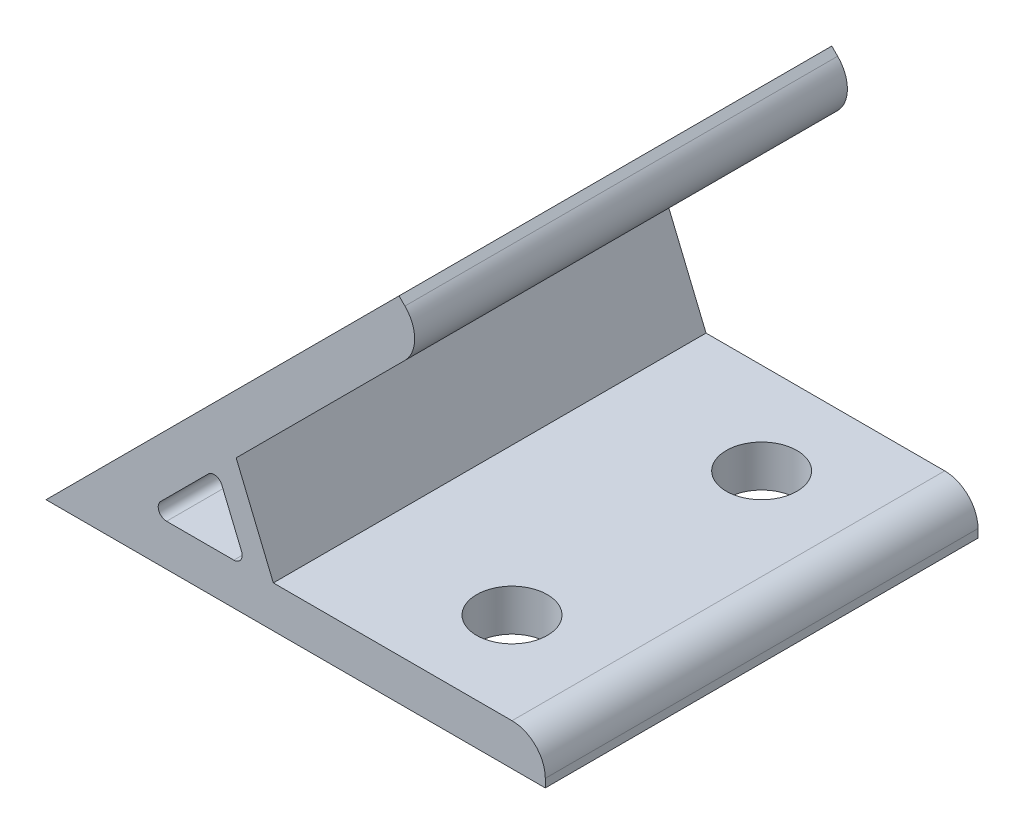
ISO-10303-21;
HEADER;
FILE_DESCRIPTION(('STEP AP214'),'2;1');
FILE_NAME('part.step','',(''),(''),'','','');
FILE_SCHEMA(('AUTOMOTIVE_DESIGN { 1 0 10303 214 1 1 1 1 }'));
ENDSEC;
DATA;
#1=APPLICATION_CONTEXT('core data for automotive mechanical design processes');
#2=APPLICATION_PROTOCOL_DEFINITION('international standard','automotive_design',2000,#1);
#3=PRODUCT_CONTEXT('',#1,'mechanical');
#4=PRODUCT('Part','Part','',(#3));
#5=PRODUCT_RELATED_PRODUCT_CATEGORY('part','',(#4));
#6=PRODUCT_DEFINITION_FORMATION('','',#4);
#7=PRODUCT_DEFINITION_CONTEXT('part definition',#1,'design');
#8=PRODUCT_DEFINITION('design','',#6,#7);
#9=PRODUCT_DEFINITION_SHAPE('','',#8);
#10=(LENGTH_UNIT() NAMED_UNIT(*) SI_UNIT(.MILLI.,.METRE.));
#11=(NAMED_UNIT(*) PLANE_ANGLE_UNIT() SI_UNIT($,.RADIAN.));
#12=(NAMED_UNIT(*) SI_UNIT($,.STERADIAN.) SOLID_ANGLE_UNIT());
#13=UNCERTAINTY_MEASURE_WITH_UNIT(LENGTH_MEASURE(1.E-05),#10,'distance_accuracy_value','');
#14=(GEOMETRIC_REPRESENTATION_CONTEXT(3) GLOBAL_UNCERTAINTY_ASSIGNED_CONTEXT((#13)) GLOBAL_UNIT_ASSIGNED_CONTEXT((#10,
#11,#12)) REPRESENTATION_CONTEXT('',''));
#15=CARTESIAN_POINT('',(0.,0.,0.));
#16=DIRECTION('',(0.,0.,1.));
#17=DIRECTION('',(1.,0.,0.));
#18=AXIS2_PLACEMENT_3D('',#15,#16,#17);
#19=CARTESIAN_POINT('',(0.,0.,26.));
#20=DIRECTION('',(0.,0.,1.));
#21=DIRECTION('',(1.,0.,0.));
#22=AXIS2_PLACEMENT_3D('',#19,#20,#21);
#23=PLANE('',#22);
#24=DIRECTION('',(0.,1.,0.));
#25=VECTOR('',#24,1.);
#26=CARTESIAN_POINT('',(60.,5.,26.));
#27=LINE('',#26,#25);
#28=CARTESIAN_POINT('',(60.,0.,26.));
#29=VERTEX_POINT('',#28);
#30=CARTESIAN_POINT('',(60.,1.,26.));
#31=VERTEX_POINT('',#30);
#32=EDGE_CURVE('E141',#29,#31,#27,.T.);
#33=ORIENTED_EDGE('',*,*,#32,.T.);
#34=CARTESIAN_POINT('',(56.,1.,26.));
#35=DIRECTION('',(0.,0.,1.));
#36=DIRECTION('',(1.,0.,0.));
#37=AXIS2_PLACEMENT_3D('',#34,#35,#36);
#38=CIRCLE('',#37,4.);
#39=CARTESIAN_POINT('',(56.,5.,26.));
#40=VERTEX_POINT('',#39);
#41=EDGE_CURVE('E183',#31,#40,#38,.T.);
#42=ORIENTED_EDGE('',*,*,#41,.T.);
#43=DIRECTION('',(-1.,0.,0.));
#44=VECTOR('',#43,1.);
#45=CARTESIAN_POINT('',(27.3182444127427,5.,26.));
#46=LINE('',#45,#44);
#47=CARTESIAN_POINT('',(27.3182444127427,5.,26.));
#48=VERTEX_POINT('',#47);
#49=EDGE_CURVE('E152',#40,#48,#46,.T.);
#50=ORIENTED_EDGE('',*,*,#49,.T.);
#51=DIRECTION('',(-0.382683432365088,0.923879532511288,0.));
#52=VECTOR('',#51,1.);
#53=CARTESIAN_POINT('',(22.8524497802947,15.781381968429,26.));
#54=LINE('',#53,#52);
#55=CARTESIAN_POINT('',(22.8524497802947,15.781381968429,26.));
#56=VERTEX_POINT('',#55);
#57=EDGE_CURVE('E243',#48,#56,#54,.T.);
#58=ORIENTED_EDGE('',*,*,#57,.T.);
#59=DIRECTION('',(0.707106781186551,0.707106781186544,0.));
#60=VECTOR('',#59,1.);
#61=CARTESIAN_POINT('',(45.9619407771258,38.8908729652599,26.));
#62=LINE('',#61,#60);
#63=CARTESIAN_POINT('',(43.1335136523796,36.0624458405137,26.));
#64=VERTEX_POINT('',#63);
#65=EDGE_CURVE('E245',#56,#64,#62,.T.);
#66=ORIENTED_EDGE('',*,*,#65,.T.);
#67=CARTESIAN_POINT('',(40.3050865276334,38.8908729652599,26.));
#68=DIRECTION('',(0.,0.,1.));
#69=DIRECTION('',(1.,0.,0.));
#70=AXIS2_PLACEMENT_3D('',#67,#68,#69);
#71=CIRCLE('',#70,4.);
#72=CARTESIAN_POINT('',(43.1335136523796,41.7193000900061,26.));
#73=VERTEX_POINT('',#72);
#74=EDGE_CURVE('E181',#64,#73,#71,.T.);
#75=ORIENTED_EDGE('',*,*,#74,.T.);
#76=DIRECTION('',(-0.707106781186544,0.707106781186551,0.));
#77=VECTOR('',#76,1.);
#78=CARTESIAN_POINT('',(42.4264068711931,42.4264068711926,26.));
#79=LINE('',#78,#77);
#80=CARTESIAN_POINT('',(42.4264068711931,42.4264068711926,26.));
#81=VERTEX_POINT('',#80);
#82=EDGE_CURVE('E248',#73,#81,#79,.T.);
#83=ORIENTED_EDGE('',*,*,#82,.T.);
#84=DIRECTION('',(-0.707106781186551,-0.707106781186544,0.));
#85=VECTOR('',#84,1.);
#86=CARTESIAN_POINT('',(0.,0.,26.));
#87=LINE('',#86,#85);
#88=CARTESIAN_POINT('',(0.,0.,26.));
#89=VERTEX_POINT('',#88);
#90=EDGE_CURVE('E157',#81,#89,#87,.T.);
#91=ORIENTED_EDGE('',*,*,#90,.T.);
#92=DIRECTION('',(1.,0.,0.));
#93=VECTOR('',#92,1.);
#94=CARTESIAN_POINT('',(60.,0.,26.));
#95=LINE('',#94,#93);
#96=EDGE_CURVE('E153',#89,#29,#95,.T.);
#97=ORIENTED_EDGE('',*,*,#96,.T.);
#98=EDGE_LOOP('',(#33,#42,#50,#58,#66,#75,#83,#91,#97));
#99=FACE_BOUND('',#98,.T.);
#100=DIRECTION('',(1.,0.,0.));
#101=VECTOR('',#100,1.);
#102=CARTESIAN_POINT('',(24.0710678118656,5.,26.));
#103=LINE('',#102,#101);
#104=CARTESIAN_POINT('',(14.4852813742387,5.,26.));
#105=VERTEX_POINT('',#104);
#106=CARTESIAN_POINT('',(22.5744620492001,5.,26.));
#107=VERTEX_POINT('',#106);
#108=EDGE_CURVE('E228',#105,#107,#103,.T.);
#109=ORIENTED_EDGE('',*,*,#108,.F.);
#110=CARTESIAN_POINT('',(14.4852813742387,6.,26.));
#111=DIRECTION('',(0.,0.,1.));
#112=DIRECTION('',(1.,0.,0.));
#113=AXIS2_PLACEMENT_3D('',#110,#111,#112);
#114=CIRCLE('',#113,1.);
#115=CARTESIAN_POINT('',(13.7781745930522,6.70710678118655,26.));
#116=VERTEX_POINT('',#115);
#117=EDGE_CURVE('E210',#105,#116,#114,.F.);
#118=ORIENTED_EDGE('',*,*,#117,.T.);
#119=DIRECTION('',(-0.707106781186549,-0.707106781186546,0.));
#120=VECTOR('',#119,1.);
#121=CARTESIAN_POINT('',(12.0710678118656,4.99999999999999,26.));
#122=LINE('',#121,#120);
#123=CARTESIAN_POINT('',(19.4980891025605,12.4270212906949,26.));
#124=VERTEX_POINT('',#123);
#125=EDGE_CURVE('E225',#124,#116,#122,.T.);
#126=ORIENTED_EDGE('',*,*,#125,.F.);
#127=CARTESIAN_POINT('',(20.2051958837471,11.7199145095083,26.));
#128=DIRECTION('',(0.,0.,1.));
#129=DIRECTION('',(1.,0.,0.));
#130=AXIS2_PLACEMENT_3D('',#127,#128,#129);
#131=CIRCLE('',#130,1.);
#132=CARTESIAN_POINT('',(21.1290754162584,12.1025979418734,26.));
#133=VERTEX_POINT('',#132);
#134=EDGE_CURVE('E206',#124,#133,#131,.F.);
#135=ORIENTED_EDGE('',*,*,#134,.T.);
#136=DIRECTION('',(-0.382683432365088,0.923879532511288,0.));
#137=VECTOR('',#136,1.);
#138=CARTESIAN_POINT('',(20.5563491861042,13.4852813742385,26.));
#139=LINE('',#138,#137);
#140=CARTESIAN_POINT('',(23.4983415817114,6.38268343236509,26.));
#141=VERTEX_POINT('',#140);
#142=EDGE_CURVE('E230',#141,#133,#139,.T.);
#143=ORIENTED_EDGE('',*,*,#142,.F.);
#144=CARTESIAN_POINT('',(22.5744620492001,6.,26.));
#145=DIRECTION('',(0.,0.,1.));
#146=DIRECTION('',(1.,0.,0.));
#147=AXIS2_PLACEMENT_3D('',#144,#145,#146);
#148=CIRCLE('',#147,1.);
#149=EDGE_CURVE('E11',#141,#107,#148,.F.);
#150=ORIENTED_EDGE('',*,*,#149,.T.);
#151=EDGE_LOOP('',(#109,#118,#126,#135,#143,#150));
#152=FACE_BOUND('',#151,.T.);
#153=ADVANCED_FACE('F34',(#99,#152),#23,.T.);
#154=CARTESIAN_POINT('',(0.,0.,-26.));
#155=DIRECTION('',(0.,0.,1.));
#156=DIRECTION('',(1.,0.,0.));
#157=AXIS2_PLACEMENT_3D('',#154,#155,#156);
#158=PLANE('',#157);
#159=DIRECTION('',(-1.,0.,0.));
#160=VECTOR('',#159,1.);
#161=CARTESIAN_POINT('',(27.3182444127427,5.,-26.));
#162=LINE('',#161,#160);
#163=CARTESIAN_POINT('',(56.,5.,-26.));
#164=VERTEX_POINT('',#163);
#165=CARTESIAN_POINT('',(27.3182444127427,5.,-26.));
#166=VERTEX_POINT('',#165);
#167=EDGE_CURVE('E255',#164,#166,#162,.T.);
#168=ORIENTED_EDGE('',*,*,#167,.F.);
#169=CARTESIAN_POINT('',(56.,1.,-26.));
#170=DIRECTION('',(0.,0.,1.));
#171=DIRECTION('',(1.,0.,0.));
#172=AXIS2_PLACEMENT_3D('',#169,#170,#171);
#173=CIRCLE('',#172,4.);
#174=CARTESIAN_POINT('',(60.,1.,-26.));
#175=VERTEX_POINT('',#174);
#176=EDGE_CURVE('E178',#164,#175,#173,.F.);
#177=ORIENTED_EDGE('',*,*,#176,.T.);
#178=DIRECTION('',(0.,1.,0.));
#179=VECTOR('',#178,1.);
#180=CARTESIAN_POINT('',(60.,5.,-26.));
#181=LINE('',#180,#179);
#182=CARTESIAN_POINT('',(60.,0.,-26.));
#183=VERTEX_POINT('',#182);
#184=EDGE_CURVE('E253',#183,#175,#181,.T.);
#185=ORIENTED_EDGE('',*,*,#184,.F.);
#186=DIRECTION('',(1.,0.,0.));
#187=VECTOR('',#186,1.);
#188=CARTESIAN_POINT('',(60.,0.,-26.));
#189=LINE('',#188,#187);
#190=CARTESIAN_POINT('',(0.,0.,-26.));
#191=VERTEX_POINT('',#190);
#192=EDGE_CURVE('E165',#191,#183,#189,.T.);
#193=ORIENTED_EDGE('',*,*,#192,.F.);
#194=DIRECTION('',(-0.707106781186551,-0.707106781186544,0.));
#195=VECTOR('',#194,1.);
#196=CARTESIAN_POINT('',(0.,0.,-26.));
#197=LINE('',#196,#195);
#198=CARTESIAN_POINT('',(42.4264068711931,42.4264068711926,-26.));
#199=VERTEX_POINT('',#198);
#200=EDGE_CURVE('E161',#199,#191,#197,.T.);
#201=ORIENTED_EDGE('',*,*,#200,.F.);
#202=DIRECTION('',(-0.707106781186544,0.707106781186551,0.));
#203=VECTOR('',#202,1.);
#204=CARTESIAN_POINT('',(42.4264068711931,42.4264068711926,-26.));
#205=LINE('',#204,#203);
#206=CARTESIAN_POINT('',(43.1335136523796,41.7193000900061,-26.));
#207=VERTEX_POINT('',#206);
#208=EDGE_CURVE('E262',#207,#199,#205,.T.);
#209=ORIENTED_EDGE('',*,*,#208,.F.);
#210=CARTESIAN_POINT('',(40.3050865276334,38.8908729652599,-26.));
#211=DIRECTION('',(0.,0.,1.));
#212=DIRECTION('',(1.,0.,0.));
#213=AXIS2_PLACEMENT_3D('',#210,#211,#212);
#214=CIRCLE('',#213,4.);
#215=CARTESIAN_POINT('',(43.1335136523796,36.0624458405137,-26.));
#216=VERTEX_POINT('',#215);
#217=EDGE_CURVE('E170',#207,#216,#214,.F.);
#218=ORIENTED_EDGE('',*,*,#217,.T.);
#219=DIRECTION('',(0.707106781186551,0.707106781186544,0.));
#220=VECTOR('',#219,1.);
#221=CARTESIAN_POINT('',(45.9619407771258,38.8908729652599,-26.));
#222=LINE('',#221,#220);
#223=CARTESIAN_POINT('',(22.8524497802947,15.781381968429,-26.));
#224=VERTEX_POINT('',#223);
#225=EDGE_CURVE('E259',#224,#216,#222,.T.);
#226=ORIENTED_EDGE('',*,*,#225,.F.);
#227=DIRECTION('',(-0.382683432365088,0.923879532511288,0.));
#228=VECTOR('',#227,1.);
#229=CARTESIAN_POINT('',(22.8524497802947,15.781381968429,-26.));
#230=LINE('',#229,#228);
#231=EDGE_CURVE('E257',#166,#224,#230,.T.);
#232=ORIENTED_EDGE('',*,*,#231,.F.);
#233=EDGE_LOOP('',(#168,#177,#185,#193,#201,#209,#218,#226,#232));
#234=FACE_BOUND('',#233,.T.);
#235=DIRECTION('',(-0.382683432365088,0.923879532511288,0.));
#236=VECTOR('',#235,1.);
#237=CARTESIAN_POINT('',(20.5563491861042,13.4852813742385,-26.));
#238=LINE('',#237,#236);
#239=CARTESIAN_POINT('',(23.4983415817114,6.38268343236509,-26.));
#240=VERTEX_POINT('',#239);
#241=CARTESIAN_POINT('',(21.1290754162584,12.1025979418734,-26.));
#242=VERTEX_POINT('',#241);
#243=EDGE_CURVE('E216',#240,#242,#238,.T.);
#244=ORIENTED_EDGE('',*,*,#243,.T.);
#245=CARTESIAN_POINT('',(20.2051958837471,11.7199145095083,-26.));
#246=DIRECTION('',(0.,0.,1.));
#247=DIRECTION('',(1.,0.,0.));
#248=AXIS2_PLACEMENT_3D('',#245,#246,#247);
#249=CIRCLE('',#248,1.);
#250=CARTESIAN_POINT('',(19.4980891025605,12.4270212906949,-26.));
#251=VERTEX_POINT('',#250);
#252=EDGE_CURVE('E204',#242,#251,#249,.T.);
#253=ORIENTED_EDGE('',*,*,#252,.T.);
#254=DIRECTION('',(-0.707106781186549,-0.707106781186546,0.));
#255=VECTOR('',#254,1.);
#256=CARTESIAN_POINT('',(12.0710678118656,4.99999999999999,-26.));
#257=LINE('',#256,#255);
#258=CARTESIAN_POINT('',(13.7781745930522,6.70710678118655,-26.));
#259=VERTEX_POINT('',#258);
#260=EDGE_CURVE('E237',#251,#259,#257,.T.);
#261=ORIENTED_EDGE('',*,*,#260,.T.);
#262=CARTESIAN_POINT('',(14.4852813742387,6.,-26.));
#263=DIRECTION('',(0.,0.,1.));
#264=DIRECTION('',(1.,0.,0.));
#265=AXIS2_PLACEMENT_3D('',#262,#263,#264);
#266=CIRCLE('',#265,1.);
#267=CARTESIAN_POINT('',(14.4852813742387,5.,-26.));
#268=VERTEX_POINT('',#267);
#269=EDGE_CURVE('E208',#259,#268,#266,.T.);
#270=ORIENTED_EDGE('',*,*,#269,.T.);
#271=DIRECTION('',(1.,0.,0.));
#272=VECTOR('',#271,1.);
#273=CARTESIAN_POINT('',(24.0710678118656,5.,-26.));
#274=LINE('',#273,#272);
#275=CARTESIAN_POINT('',(22.5744620492001,5.,-26.));
#276=VERTEX_POINT('',#275);
#277=EDGE_CURVE('E217',#268,#276,#274,.T.);
#278=ORIENTED_EDGE('',*,*,#277,.T.);
#279=CARTESIAN_POINT('',(22.5744620492001,6.,-26.));
#280=DIRECTION('',(0.,0.,1.));
#281=DIRECTION('',(1.,0.,0.));
#282=AXIS2_PLACEMENT_3D('',#279,#280,#281);
#283=CIRCLE('',#282,1.);
#284=EDGE_CURVE('E42',#276,#240,#283,.T.);
#285=ORIENTED_EDGE('',*,*,#284,.T.);
#286=EDGE_LOOP('',(#244,#253,#261,#270,#278,#285));
#287=FACE_BOUND('',#286,.T.);
#288=ADVANCED_FACE('F215',(#234,#287),#158,.F.);
#289=CARTESIAN_POINT('',(60.,0.,26.));
#290=DIRECTION('',(0.,1.,0.));
#291=DIRECTION('',(0.,0.,1.));
#292=AXIS2_PLACEMENT_3D('',#289,#290,#291);
#293=PLANE('',#292);
#294=CARTESIAN_POINT('',(45.,0.,15.));
#295=DIRECTION('',(0.,-1.,0.));
#296=DIRECTION('',(0.,0.,-1.));
#297=AXIS2_PLACEMENT_3D('',#294,#295,#296);
#298=CIRCLE('',#297,4.25);
#299=CARTESIAN_POINT('',(45.,0.,10.75));
#300=VERTEX_POINT('',#299);
#301=EDGE_CURVE('E343',#300,#300,#298,.T.);
#302=ORIENTED_EDGE('',*,*,#301,.F.);
#303=EDGE_LOOP('',(#302));
#304=FACE_BOUND('',#303,.T.);
#305=CARTESIAN_POINT('',(45.,0.,-15.));
#306=DIRECTION('',(0.,-1.,0.));
#307=DIRECTION('',(0.,0.,-1.));
#308=AXIS2_PLACEMENT_3D('',#305,#306,#307);
#309=CIRCLE('',#308,4.25000000000001);
#310=CARTESIAN_POINT('',(45.,0.,-19.25));
#311=VERTEX_POINT('',#310);
#312=EDGE_CURVE('E346',#311,#311,#309,.T.);
#313=ORIENTED_EDGE('',*,*,#312,.F.);
#314=EDGE_LOOP('',(#313));
#315=FACE_BOUND('',#314,.T.);
#316=ORIENTED_EDGE('',*,*,#192,.T.);
#317=DIRECTION('',(0.,0.,-1.));
#318=VECTOR('',#317,1.);
#319=CARTESIAN_POINT('',(60.,0.,26.));
#320=LINE('',#319,#318);
#321=EDGE_CURVE('E146',#29,#183,#320,.T.);
#322=ORIENTED_EDGE('',*,*,#321,.F.);
#323=ORIENTED_EDGE('',*,*,#96,.F.);
#324=DIRECTION('',(0.,0.,-1.));
#325=VECTOR('',#324,1.);
#326=CARTESIAN_POINT('',(0.,0.,26.));
#327=LINE('',#326,#325);
#328=EDGE_CURVE('E251',#89,#191,#327,.T.);
#329=ORIENTED_EDGE('',*,*,#328,.T.);
#330=EDGE_LOOP('',(#316,#322,#323,#329));
#331=FACE_BOUND('',#330,.T.);
#332=ADVANCED_FACE('F163',(#304,#315,#331),#293,.F.);
#333=CARTESIAN_POINT('',(60.,5.,26.));
#334=DIRECTION('',(-1.,0.,0.));
#335=DIRECTION('',(0.,0.,1.));
#336=AXIS2_PLACEMENT_3D('',#333,#334,#335);
#337=PLANE('',#336);
#338=ORIENTED_EDGE('',*,*,#184,.T.);
#339=DIRECTION('',(0.,0.,-1.));
#340=VECTOR('',#339,1.);
#341=CARTESIAN_POINT('',(60.,1.,26.));
#342=LINE('',#341,#340);
#343=EDGE_CURVE('E149',#175,#31,#342,.F.);
#344=ORIENTED_EDGE('',*,*,#343,.T.);
#345=ORIENTED_EDGE('',*,*,#32,.F.);
#346=ORIENTED_EDGE('',*,*,#321,.T.);
#347=EDGE_LOOP('',(#338,#344,#345,#346));
#348=FACE_BOUND('',#347,.T.);
#349=ADVANCED_FACE('F144',(#348),#337,.F.);
#350=CARTESIAN_POINT('',(27.3182444127427,5.,26.));
#351=DIRECTION('',(0.,-1.,0.));
#352=DIRECTION('',(0.,0.,-1.));
#353=AXIS2_PLACEMENT_3D('',#350,#351,#352);
#354=PLANE('',#353);
#355=CARTESIAN_POINT('',(45.,5.,15.));
#356=DIRECTION('',(0.,-1.,0.));
#357=DIRECTION('',(0.,0.,-1.));
#358=AXIS2_PLACEMENT_3D('',#355,#356,#357);
#359=CIRCLE('',#358,4.25);
#360=CARTESIAN_POINT('',(45.,5.,10.75));
#361=VERTEX_POINT('',#360);
#362=EDGE_CURVE('E353',#361,#361,#359,.F.);
#363=ORIENTED_EDGE('',*,*,#362,.F.);
#364=EDGE_LOOP('',(#363));
#365=FACE_BOUND('',#364,.T.);
#366=CARTESIAN_POINT('',(45.,5.,-15.));
#367=DIRECTION('',(0.,-1.,0.));
#368=DIRECTION('',(0.,0.,-1.));
#369=AXIS2_PLACEMENT_3D('',#366,#367,#368);
#370=CIRCLE('',#369,4.25000000000001);
#371=CARTESIAN_POINT('',(45.,5.,-19.25));
#372=VERTEX_POINT('',#371);
#373=EDGE_CURVE('E348',#372,#372,#370,.F.);
#374=ORIENTED_EDGE('',*,*,#373,.F.);
#375=EDGE_LOOP('',(#374));
#376=FACE_BOUND('',#375,.T.);
#377=ORIENTED_EDGE('',*,*,#49,.F.);
#378=DIRECTION('',(0.,0.,-1.));
#379=VECTOR('',#378,1.);
#380=CARTESIAN_POINT('',(56.,5.,26.));
#381=LINE('',#380,#379);
#382=EDGE_CURVE('E166',#40,#164,#381,.T.);
#383=ORIENTED_EDGE('',*,*,#382,.T.);
#384=ORIENTED_EDGE('',*,*,#167,.T.);
#385=DIRECTION('',(0.,0.,-1.));
#386=VECTOR('',#385,1.);
#387=CARTESIAN_POINT('',(27.3182444127427,5.,26.));
#388=LINE('',#387,#386);
#389=EDGE_CURVE('E167',#48,#166,#388,.T.);
#390=ORIENTED_EDGE('',*,*,#389,.F.);
#391=EDGE_LOOP('',(#377,#383,#384,#390));
#392=FACE_BOUND('',#391,.T.);
#393=ADVANCED_FACE('F294',(#365,#376,#392),#354,.F.);
#394=CARTESIAN_POINT('',(22.8524497802947,15.781381968429,26.));
#395=DIRECTION('',(-0.923879532511288,-0.382683432365088,0.));
#396=DIRECTION('',(0.382683432365088,-0.923879532511288,0.));
#397=AXIS2_PLACEMENT_3D('',#394,#395,#396);
#398=PLANE('',#397);
#399=ORIENTED_EDGE('',*,*,#231,.T.);
#400=DIRECTION('',(0.,0.,-1.));
#401=VECTOR('',#400,1.);
#402=CARTESIAN_POINT('',(22.8524497802947,15.781381968429,26.));
#403=LINE('',#402,#401);
#404=EDGE_CURVE('E173',#56,#224,#403,.T.);
#405=ORIENTED_EDGE('',*,*,#404,.F.);
#406=ORIENTED_EDGE('',*,*,#57,.F.);
#407=ORIENTED_EDGE('',*,*,#389,.T.);
#408=EDGE_LOOP('',(#399,#405,#406,#407));
#409=FACE_BOUND('',#408,.T.);
#410=ADVANCED_FACE('F292',(#409),#398,.F.);
#411=CARTESIAN_POINT('',(45.9619407771258,38.8908729652599,26.));
#412=DIRECTION('',(-0.707106781186544,0.707106781186551,0.));
#413=DIRECTION('',(-0.707106781186551,-0.707106781186544,0.));
#414=AXIS2_PLACEMENT_3D('',#411,#412,#413);
#415=PLANE('',#414);
#416=CARTESIAN_POINT('',(35.3553390593275,28.2842712474617,-15.));
#417=DIRECTION('',(-0.707106781186544,0.707106781186551,0.));
#418=DIRECTION('',(-0.707106781186551,-0.707106781186544,0.));
#419=AXIS2_PLACEMENT_3D('',#416,#417,#418);
#420=CIRCLE('',#419,4.25);
#421=CARTESIAN_POINT('',(32.3501352392847,25.2790674274189,-15.));
#422=VERTEX_POINT('',#421);
#423=EDGE_CURVE('E240',#422,#422,#420,.F.);
#424=ORIENTED_EDGE('',*,*,#423,.F.);
#425=EDGE_LOOP('',(#424));
#426=FACE_BOUND('',#425,.T.);
#427=CARTESIAN_POINT('',(35.3553390593275,28.2842712474617,15.));
#428=DIRECTION('',(-0.707106781186544,0.707106781186551,0.));
#429=DIRECTION('',(-0.707106781186551,-0.707106781186544,0.));
#430=AXIS2_PLACEMENT_3D('',#427,#428,#429);
#431=CIRCLE('',#430,4.25000000000001);
#432=CARTESIAN_POINT('',(32.3501352392847,25.2790674274189,15.));
#433=VERTEX_POINT('',#432);
#434=EDGE_CURVE('E359',#433,#433,#431,.F.);
#435=ORIENTED_EDGE('',*,*,#434,.F.);
#436=EDGE_LOOP('',(#435));
#437=FACE_BOUND('',#436,.T.);
#438=ORIENTED_EDGE('',*,*,#225,.T.);
#439=DIRECTION('',(0.,0.,-1.));
#440=VECTOR('',#439,1.);
#441=CARTESIAN_POINT('',(43.1335136523796,36.0624458405137,26.));
#442=LINE('',#441,#440);
#443=EDGE_CURVE('E188',#216,#64,#442,.F.);
#444=ORIENTED_EDGE('',*,*,#443,.T.);
#445=ORIENTED_EDGE('',*,*,#65,.F.);
#446=ORIENTED_EDGE('',*,*,#404,.T.);
#447=EDGE_LOOP('',(#438,#444,#445,#446));
#448=FACE_BOUND('',#447,.T.);
#449=ADVANCED_FACE('F273',(#426,#437,#448),#415,.F.);
#450=CARTESIAN_POINT('',(42.4264068711931,42.4264068711926,26.));
#451=DIRECTION('',(-0.707106781186551,-0.707106781186544,0.));
#452=DIRECTION('',(0.707106781186544,-0.707106781186551,0.));
#453=AXIS2_PLACEMENT_3D('',#450,#451,#452);
#454=PLANE('',#453);
#455=ORIENTED_EDGE('',*,*,#82,.F.);
#456=DIRECTION('',(0.,0.,-1.));
#457=VECTOR('',#456,1.);
#458=CARTESIAN_POINT('',(43.1335136523796,41.7193000900061,26.));
#459=LINE('',#458,#457);
#460=EDGE_CURVE('E185',#73,#207,#459,.T.);
#461=ORIENTED_EDGE('',*,*,#460,.T.);
#462=ORIENTED_EDGE('',*,*,#208,.T.);
#463=DIRECTION('',(0.,0.,-1.));
#464=VECTOR('',#463,1.);
#465=CARTESIAN_POINT('',(42.4264068711931,42.4264068711926,26.));
#466=LINE('',#465,#464);
#467=EDGE_CURVE('E266',#81,#199,#466,.T.);
#468=ORIENTED_EDGE('',*,*,#467,.F.);
#469=EDGE_LOOP('',(#455,#461,#462,#468));
#470=FACE_BOUND('',#469,.T.);
#471=ADVANCED_FACE('F288',(#470),#454,.F.);
#472=CARTESIAN_POINT('',(0.,0.,26.));
#473=DIRECTION('',(0.707106781186544,-0.707106781186551,0.));
#474=DIRECTION('',(0.707106781186551,0.707106781186544,0.));
#475=AXIS2_PLACEMENT_3D('',#472,#473,#474);
#476=PLANE('',#475);
#477=CARTESIAN_POINT('',(31.8198051533948,31.8198051533945,-15.));
#478=DIRECTION('',(-0.707106781186544,0.707106781186551,0.));
#479=DIRECTION('',(-0.707106781186551,-0.707106781186544,0.));
#480=AXIS2_PLACEMENT_3D('',#477,#478,#479);
#481=CIRCLE('',#480,4.25);
#482=CARTESIAN_POINT('',(28.814601333352,28.8146013333517,-15.));
#483=VERTEX_POINT('',#482);
#484=EDGE_CURVE('E356',#483,#483,#481,.T.);
#485=ORIENTED_EDGE('',*,*,#484,.F.);
#486=EDGE_LOOP('',(#485));
#487=FACE_BOUND('',#486,.T.);
#488=CARTESIAN_POINT('',(31.8198051533948,31.8198051533945,15.));
#489=DIRECTION('',(-0.707106781186544,0.707106781186551,0.));
#490=DIRECTION('',(-0.707106781186551,-0.707106781186544,0.));
#491=AXIS2_PLACEMENT_3D('',#488,#489,#490);
#492=CIRCLE('',#491,4.25000000000001);
#493=CARTESIAN_POINT('',(28.814601333352,28.8146013333517,15.));
#494=VERTEX_POINT('',#493);
#495=EDGE_CURVE('E362',#494,#494,#492,.T.);
#496=ORIENTED_EDGE('',*,*,#495,.F.);
#497=EDGE_LOOP('',(#496));
#498=FACE_BOUND('',#497,.T.);
#499=ORIENTED_EDGE('',*,*,#200,.T.);
#500=ORIENTED_EDGE('',*,*,#328,.F.);
#501=ORIENTED_EDGE('',*,*,#90,.F.);
#502=ORIENTED_EDGE('',*,*,#467,.T.);
#503=EDGE_LOOP('',(#499,#500,#501,#502));
#504=FACE_BOUND('',#503,.T.);
#505=ADVANCED_FACE('F321',(#487,#498,#504),#476,.F.);
#506=CARTESIAN_POINT('',(12.0710678118656,4.99999999999999,26.));
#507=DIRECTION('',(0.707106781186546,-0.707106781186549,0.));
#508=DIRECTION('',(0.707106781186549,0.707106781186546,0.));
#509=AXIS2_PLACEMENT_3D('',#506,#507,#508);
#510=PLANE('',#509);
#511=ORIENTED_EDGE('',*,*,#260,.F.);
#512=DIRECTION('',(0.,0.,-1.));
#513=VECTOR('',#512,1.);
#514=CARTESIAN_POINT('',(19.4980891025605,12.4270212906949,26.));
#515=LINE('',#514,#513);
#516=EDGE_CURVE('E198',#251,#124,#515,.F.);
#517=ORIENTED_EDGE('',*,*,#516,.T.);
#518=ORIENTED_EDGE('',*,*,#125,.T.);
#519=DIRECTION('',(0.,0.,-1.));
#520=VECTOR('',#519,1.);
#521=CARTESIAN_POINT('',(13.7781745930522,6.70710678118655,-26.));
#522=LINE('',#521,#520);
#523=EDGE_CURVE('E195',#116,#259,#522,.T.);
#524=ORIENTED_EDGE('',*,*,#523,.T.);
#525=EDGE_LOOP('',(#511,#517,#518,#524));
#526=FACE_BOUND('',#525,.T.);
#527=ADVANCED_FACE('F318',(#526),#510,.T.);
#528=CARTESIAN_POINT('',(24.0710678118656,5.,26.));
#529=DIRECTION('',(0.,1.,0.));
#530=DIRECTION('',(-1.,0.,0.));
#531=AXIS2_PLACEMENT_3D('',#528,#529,#530);
#532=PLANE('',#531);
#533=ORIENTED_EDGE('',*,*,#277,.F.);
#534=DIRECTION('',(0.,0.,-1.));
#535=VECTOR('',#534,1.);
#536=CARTESIAN_POINT('',(14.4852813742387,5.,26.));
#537=LINE('',#536,#535);
#538=EDGE_CURVE('E54',#268,#105,#537,.F.);
#539=ORIENTED_EDGE('',*,*,#538,.T.);
#540=ORIENTED_EDGE('',*,*,#108,.T.);
#541=DIRECTION('',(0.,0.,-1.));
#542=VECTOR('',#541,1.);
#543=CARTESIAN_POINT('',(22.5744620492001,5.,-26.));
#544=LINE('',#543,#542);
#545=EDGE_CURVE('E200',#107,#276,#544,.T.);
#546=ORIENTED_EDGE('',*,*,#545,.T.);
#547=EDGE_LOOP('',(#533,#539,#540,#546));
#548=FACE_BOUND('',#547,.T.);
#549=ADVANCED_FACE('F227',(#548),#532,.T.);
#550=CARTESIAN_POINT('',(20.5563491861042,13.4852813742385,26.));
#551=DIRECTION('',(-0.923879532511288,-0.382683432365088,0.));
#552=DIRECTION('',(0.382683432365088,-0.923879532511288,0.));
#553=AXIS2_PLACEMENT_3D('',#550,#551,#552);
#554=PLANE('',#553);
#555=ORIENTED_EDGE('',*,*,#142,.T.);
#556=DIRECTION('',(0.,0.,-1.));
#557=VECTOR('',#556,1.);
#558=CARTESIAN_POINT('',(21.1290754162584,12.1025979418734,-26.));
#559=LINE('',#558,#557);
#560=EDGE_CURVE('E192',#133,#242,#559,.T.);
#561=ORIENTED_EDGE('',*,*,#560,.T.);
#562=ORIENTED_EDGE('',*,*,#243,.F.);
#563=DIRECTION('',(0.,0.,-1.));
#564=VECTOR('',#563,1.);
#565=CARTESIAN_POINT('',(23.4983415817114,6.38268343236509,26.));
#566=LINE('',#565,#564);
#567=EDGE_CURVE('E190',#240,#141,#566,.F.);
#568=ORIENTED_EDGE('',*,*,#567,.T.);
#569=EDGE_LOOP('',(#555,#561,#562,#568));
#570=FACE_BOUND('',#569,.T.);
#571=ADVANCED_FACE('F223',(#570),#554,.T.);
#572=CARTESIAN_POINT('',(43.8553390593275,19.7842712474617,15.));
#573=DIRECTION('',(-0.707106781186544,0.707106781186551,0.));
#574=DIRECTION('',(-0.707106781186551,-0.707106781186544,0.));
#575=AXIS2_PLACEMENT_3D('',#572,#573,#574);
#576=CYLINDRICAL_SURFACE('',#575,4.25000000000001);
#577=ORIENTED_EDGE('',*,*,#434,.T.);
#578=EDGE_LOOP('',(#577));
#579=FACE_BOUND('',#578,.T.);
#580=ORIENTED_EDGE('',*,*,#495,.T.);
#581=EDGE_LOOP('',(#580));
#582=FACE_BOUND('',#581,.T.);
#583=ADVANCED_FACE('F367',(#579,#582),#576,.F.);
#584=CARTESIAN_POINT('',(43.8553390593275,19.7842712474617,-15.));
#585=DIRECTION('',(-0.707106781186544,0.707106781186551,0.));
#586=DIRECTION('',(-0.707106781186551,-0.707106781186544,0.));
#587=AXIS2_PLACEMENT_3D('',#584,#585,#586);
#588=CYLINDRICAL_SURFACE('',#587,4.25);
#589=ORIENTED_EDGE('',*,*,#423,.T.);
#590=EDGE_LOOP('',(#589));
#591=FACE_BOUND('',#590,.T.);
#592=ORIENTED_EDGE('',*,*,#484,.T.);
#593=EDGE_LOOP('',(#592));
#594=FACE_BOUND('',#593,.T.);
#595=ADVANCED_FACE('F371',(#591,#594),#588,.F.);
#596=CARTESIAN_POINT('',(45.,17.0208152801713,-15.));
#597=DIRECTION('',(0.,-1.,0.));
#598=DIRECTION('',(0.,0.,-1.));
#599=AXIS2_PLACEMENT_3D('',#596,#597,#598);
#600=CYLINDRICAL_SURFACE('',#599,4.25000000000001);
#601=ORIENTED_EDGE('',*,*,#373,.T.);
#602=EDGE_LOOP('',(#601));
#603=FACE_BOUND('',#602,.T.);
#604=ORIENTED_EDGE('',*,*,#312,.T.);
#605=EDGE_LOOP('',(#604));
#606=FACE_BOUND('',#605,.T.);
#607=ADVANCED_FACE('F307',(#603,#606),#600,.F.);
#608=CARTESIAN_POINT('',(45.,17.0208152801713,15.));
#609=DIRECTION('',(0.,-1.,0.));
#610=DIRECTION('',(0.,0.,-1.));
#611=AXIS2_PLACEMENT_3D('',#608,#609,#610);
#612=CYLINDRICAL_SURFACE('',#611,4.25);
#613=ORIENTED_EDGE('',*,*,#362,.T.);
#614=EDGE_LOOP('',(#613));
#615=FACE_BOUND('',#614,.T.);
#616=ORIENTED_EDGE('',*,*,#301,.T.);
#617=EDGE_LOOP('',(#616));
#618=FACE_BOUND('',#617,.T.);
#619=ADVANCED_FACE('F299',(#615,#618),#612,.F.);
#620=CARTESIAN_POINT('',(56.,1.,26.));
#621=DIRECTION('',(0.,0.,-1.));
#622=DIRECTION('',(-1.,0.,0.));
#623=AXIS2_PLACEMENT_3D('',#620,#621,#622);
#624=CYLINDRICAL_SURFACE('',#623,4.);
#625=ORIENTED_EDGE('',*,*,#41,.F.);
#626=ORIENTED_EDGE('',*,*,#343,.F.);
#627=ORIENTED_EDGE('',*,*,#176,.F.);
#628=ORIENTED_EDGE('',*,*,#382,.F.);
#629=EDGE_LOOP('',(#625,#626,#627,#628));
#630=FACE_BOUND('',#629,.T.);
#631=ADVANCED_FACE('F297',(#630),#624,.T.);
#632=CARTESIAN_POINT('',(40.3050865276334,38.8908729652599,26.));
#633=DIRECTION('',(0.,0.,-1.));
#634=DIRECTION('',(-1.,0.,0.));
#635=AXIS2_PLACEMENT_3D('',#632,#633,#634);
#636=CYLINDRICAL_SURFACE('',#635,4.);
#637=ORIENTED_EDGE('',*,*,#74,.F.);
#638=ORIENTED_EDGE('',*,*,#443,.F.);
#639=ORIENTED_EDGE('',*,*,#217,.F.);
#640=ORIENTED_EDGE('',*,*,#460,.F.);
#641=EDGE_LOOP('',(#637,#638,#639,#640));
#642=FACE_BOUND('',#641,.T.);
#643=ADVANCED_FACE('F285',(#642),#636,.T.);
#644=CARTESIAN_POINT('',(20.2051958837471,11.7199145095083,26.));
#645=DIRECTION('',(0.,0.,1.));
#646=DIRECTION('',(1.,0.,0.));
#647=AXIS2_PLACEMENT_3D('',#644,#645,#646);
#648=CYLINDRICAL_SURFACE('',#647,1.);
#649=ORIENTED_EDGE('',*,*,#134,.F.);
#650=ORIENTED_EDGE('',*,*,#516,.F.);
#651=ORIENTED_EDGE('',*,*,#252,.F.);
#652=ORIENTED_EDGE('',*,*,#560,.F.);
#653=EDGE_LOOP('',(#649,#650,#651,#652));
#654=FACE_BOUND('',#653,.T.);
#655=ADVANCED_FACE('F305',(#654),#648,.F.);
#656=CARTESIAN_POINT('',(14.4852813742387,6.,26.));
#657=DIRECTION('',(0.,0.,1.));
#658=DIRECTION('',(1.,0.,0.));
#659=AXIS2_PLACEMENT_3D('',#656,#657,#658);
#660=CYLINDRICAL_SURFACE('',#659,1.);
#661=ORIENTED_EDGE('',*,*,#117,.F.);
#662=ORIENTED_EDGE('',*,*,#538,.F.);
#663=ORIENTED_EDGE('',*,*,#269,.F.);
#664=ORIENTED_EDGE('',*,*,#523,.F.);
#665=EDGE_LOOP('',(#661,#662,#663,#664));
#666=FACE_BOUND('',#665,.T.);
#667=ADVANCED_FACE('F398',(#666),#660,.F.);
#668=CARTESIAN_POINT('',(22.5744620492001,6.,26.));
#669=DIRECTION('',(0.,0.,1.));
#670=DIRECTION('',(1.,0.,0.));
#671=AXIS2_PLACEMENT_3D('',#668,#669,#670);
#672=CYLINDRICAL_SURFACE('',#671,1.);
#673=ORIENTED_EDGE('',*,*,#149,.F.);
#674=ORIENTED_EDGE('',*,*,#567,.F.);
#675=ORIENTED_EDGE('',*,*,#284,.F.);
#676=ORIENTED_EDGE('',*,*,#545,.F.);
#677=EDGE_LOOP('',(#673,#674,#675,#676));
#678=FACE_BOUND('',#677,.T.);
#679=ADVANCED_FACE('F36',(#678),#672,.F.);
#680=CLOSED_SHELL('',(#153,#288,#332,#349,#393,#410,#449,#471,#505,#527,#549,#571,#583,#595,
#607,#619,#631,#643,#655,#667,#679));
#681=MANIFOLD_SOLID_BREP('B2',#680);
#682=ADVANCED_BREP_SHAPE_REPRESENTATION('',(#18,#681),#14);
#683=SHAPE_DEFINITION_REPRESENTATION(#9,#682);
ENDSEC;
END-ISO-10303-21;
